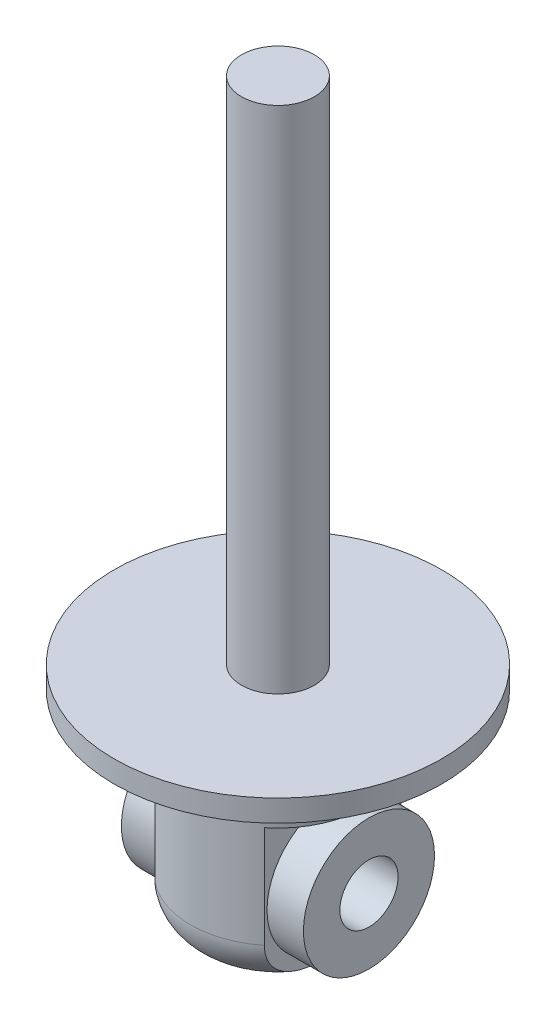
ISO-10303-21;
HEADER;
FILE_DESCRIPTION(('STEP AP214'),'2;1');
FILE_NAME('part.step','',(''),(''),'','','');
FILE_SCHEMA(('AUTOMOTIVE_DESIGN { 1 0 10303 214 1 1 1 1 }'));
ENDSEC;
DATA;
#1=APPLICATION_CONTEXT('core data for automotive mechanical design processes');
#2=APPLICATION_PROTOCOL_DEFINITION('international standard','automotive_design',2000,#1);
#3=PRODUCT_CONTEXT('',#1,'mechanical');
#4=PRODUCT('Part','Part','',(#3));
#5=PRODUCT_RELATED_PRODUCT_CATEGORY('part','',(#4));
#6=PRODUCT_DEFINITION_FORMATION('','',#4);
#7=PRODUCT_DEFINITION_CONTEXT('part definition',#1,'design');
#8=PRODUCT_DEFINITION('design','',#6,#7);
#9=PRODUCT_DEFINITION_SHAPE('','',#8);
#10=(LENGTH_UNIT() NAMED_UNIT(*) SI_UNIT(.MILLI.,.METRE.));
#11=(NAMED_UNIT(*) PLANE_ANGLE_UNIT() SI_UNIT($,.RADIAN.));
#12=(NAMED_UNIT(*) SI_UNIT($,.STERADIAN.) SOLID_ANGLE_UNIT());
#13=UNCERTAINTY_MEASURE_WITH_UNIT(LENGTH_MEASURE(1.E-05),#10,'distance_accuracy_value','');
#14=(GEOMETRIC_REPRESENTATION_CONTEXT(3) GLOBAL_UNCERTAINTY_ASSIGNED_CONTEXT((#13)) GLOBAL_UNIT_ASSIGNED_CONTEXT((#10,
#11,#12)) REPRESENTATION_CONTEXT('',''));
#15=CARTESIAN_POINT('',(0.,0.,0.));
#16=DIRECTION('',(0.,0.,1.));
#17=DIRECTION('',(1.,0.,0.));
#18=AXIS2_PLACEMENT_3D('',#15,#16,#17);
#19=CARTESIAN_POINT('',(-7.5,-28.,-14.));
#20=DIRECTION('',(1.,0.,0.));
#21=DIRECTION('',(0.,0.,-1.));
#22=AXIS2_PLACEMENT_3D('',#19,#20,#21);
#23=PLANE('',#22);
#24=CARTESIAN_POINT('',(-7.5,-27.8094750193111,0.));
#25=CARTESIAN_POINT('',(-7.5,-27.8094752958151,0.18452162824242));
#26=CARTESIAN_POINT('',(-7.5,-27.8077270322999,0.369043480287192));
#27=CARTESIAN_POINT('',(-7.5,-27.8006130628877,0.737999394292285));
#28=CARTESIAN_POINT('',(-7.5,-27.7952477367066,0.922433463434385));
#29=CARTESIAN_POINT('',(-7.5,-27.780538513706,1.29122559425462));
#30=CARTESIAN_POINT('',(-7.5,-27.7711929215574,1.47558358999919));
#31=CARTESIAN_POINT('',(-7.5,-27.7479507640883,1.84401846668315));
#32=CARTESIAN_POINT('',(-7.5,-27.734054140347,2.02809534398339));
#33=CARTESIAN_POINT('',(-7.5,-27.701027325669,2.39498843631837));
#34=CARTESIAN_POINT('',(-7.5,-27.6819201299087,2.57780665418326));
#35=CARTESIAN_POINT('',(-7.5,-27.6375682217561,2.94269408038084));
#36=CARTESIAN_POINT('',(-7.5,-27.6123230495969,3.12476323156505));
#37=CARTESIAN_POINT('',(-7.5,-27.5259360262262,3.6691632505479));
#38=CARTESIAN_POINT('',(-7.5,-27.4541196223952,4.02997739530099));
#39=CARTESIAN_POINT('',(-7.5,-27.315114172541,4.57935988961709));
#40=CARTESIAN_POINT('',(-7.5,-27.2608348848703,4.77122256452969));
#41=CARTESIAN_POINT('',(-7.5,-27.1402411036094,5.15109529504943));
#42=CARTESIAN_POINT('',(-7.5,-27.0739312594077,5.33910680786539));
#43=CARTESIAN_POINT('',(-7.5,-26.9281486989919,5.70992505463463));
#44=CARTESIAN_POINT('',(-7.5,-26.8486797977089,5.8927332791208));
#45=CARTESIAN_POINT('',(-7.5,-26.6756224712841,6.25155879665883));
#46=CARTESIAN_POINT('',(-7.5,-26.5820364486501,6.42757723883459));
#47=CARTESIAN_POINT('',(-7.5,-26.3958384208508,6.74413785402998));
#48=CARTESIAN_POINT('',(-7.5,-26.3053527427416,6.8859302136676));
#49=CARTESIAN_POINT('',(-7.5,-26.1136422044668,7.16205254122039));
#50=CARTESIAN_POINT('',(-7.5,-26.0124194056704,7.29638393401336));
#51=CARTESIAN_POINT('',(-7.5,-25.7991822855038,7.55627452274061));
#52=CARTESIAN_POINT('',(-7.5,-25.6871652583255,7.6818315054992));
#53=CARTESIAN_POINT('',(-7.5,-25.4525813942248,7.92270374400352));
#54=CARTESIAN_POINT('',(-7.5,-25.3300144777409,8.03801892249803));
#55=CARTESIAN_POINT('',(-7.5,-25.0736714823962,8.25792234562975));
#56=CARTESIAN_POINT('',(-7.5,-24.9398051473305,8.36240569865935));
#57=CARTESIAN_POINT('',(-7.5,-24.662616920615,8.55796576900282));
#58=CARTESIAN_POINT('',(-7.5,-24.5192963548439,8.64904436046083));
#59=CARTESIAN_POINT('',(-7.5,-24.2243409104845,8.81636481076627));
#60=CARTESIAN_POINT('',(-7.5,-24.0727112205184,8.89261579636783));
#61=CARTESIAN_POINT('',(-7.5,-23.7624095052739,9.02909243430965));
#62=CARTESIAN_POINT('',(-7.5,-23.6037388369551,9.08932115899453));
#63=CARTESIAN_POINT('',(-7.5,-23.3052245459151,9.1849514334904));
#64=CARTESIAN_POINT('',(-7.5,-23.1661361294911,9.22272405795733));
#65=CARTESIAN_POINT('',(-7.5,-22.8851087613884,9.28547940350163));
#66=CARTESIAN_POINT('',(-7.5,-22.7431701638949,9.31046370365637));
#67=CARTESIAN_POINT('',(-7.5,-22.4576599589478,9.34730641699015));
#68=CARTESIAN_POINT('',(-7.5,-22.3140890586128,9.35917031033292));
#69=CARTESIAN_POINT('',(-7.5,-22.0264648581988,9.36963164548865));
#70=CARTESIAN_POINT('',(-7.5,-21.8824115750842,9.36822954903947));
#71=CARTESIAN_POINT('',(-7.5,-21.6061914815275,9.35280339576898));
#72=CARTESIAN_POINT('',(-7.5,-21.4739684759153,9.33976569953801));
#73=CARTESIAN_POINT('',(-7.5,-21.2110534946456,9.3025636387872));
#74=CARTESIAN_POINT('',(-7.5,-21.0803620180608,9.27839574533066));
#75=CARTESIAN_POINT('',(-7.5,-20.8215410609612,9.21922065645586));
#76=CARTESIAN_POINT('',(-7.5,-20.6934101253726,9.1842198149556));
#77=CARTESIAN_POINT('',(-7.5,-20.4404340442512,9.1037455253616));
#78=CARTESIAN_POINT('',(-7.5,-20.3155901493276,9.05826815366643));
#79=CARTESIAN_POINT('',(-7.5,-20.0692031015505,8.95699564520569));
#80=CARTESIAN_POINT('',(-7.5,-19.9476868658852,8.90113499399755));
#81=CARTESIAN_POINT('',(-7.5,-19.7094920695403,8.77987692751896));
#82=CARTESIAN_POINT('',(-7.5,-19.5928152563103,8.71447610526943));
#83=CARTESIAN_POINT('',(-7.5,-19.2509911073174,8.50489875856371));
#84=CARTESIAN_POINT('',(-7.5,-19.0339195251877,8.34729299116934));
#85=CARTESIAN_POINT('',(-7.5,-18.609337427954,7.98870608163153));
#86=CARTESIAN_POINT('',(-7.5,-18.4039002281567,7.78529755950601));
#87=CARTESIAN_POINT('',(-7.5,-18.0246758733926,7.35109040646743));
#88=CARTESIAN_POINT('',(-7.5,-17.8508837047537,7.12029612399674));
#89=CARTESIAN_POINT('',(-7.5,-17.5744409595824,6.69864287979115));
#90=CARTESIAN_POINT('',(-7.5,-17.4648689537028,6.51223410047273));
#91=CARTESIAN_POINT('',(-7.5,-17.2626904112623,6.13034538679086));
#92=CARTESIAN_POINT('',(-7.5,-17.1700919878543,5.93486117014358));
#93=CARTESIAN_POINT('',(-7.5,-17.0006313082269,5.53658641063457));
#94=CARTESIAN_POINT('',(-7.5,-16.9238147555949,5.3337765932138));
#95=CARTESIAN_POINT('',(-7.5,-16.784875362625,4.9233142846081));
#96=CARTESIAN_POINT('',(-7.5,-16.7227484430634,4.71566315546474));
#97=CARTESIAN_POINT('',(-7.5,-16.5386673542946,4.02250667384635));
#98=CARTESIAN_POINT('',(-7.5,-16.4449803111871,3.52942656369882));
#99=CARTESIAN_POINT('',(-7.5,-16.3412352530644,2.78498720051467));
#100=CARTESIAN_POINT('',(-7.5,-16.3127705467372,2.5356855777005));
#101=CARTESIAN_POINT('',(-7.5,-16.2658269581612,2.03612434937439));
#102=CARTESIAN_POINT('',(-7.5,-16.2473468655649,1.78586486368142));
#103=CARTESIAN_POINT('',(-7.5,-16.2184283009414,1.28363112408653));
#104=CARTESIAN_POINT('',(-7.5,-16.208031590786,1.03165466176092));
#105=CARTESIAN_POINT('',(-7.5,-16.1941849220444,0.527501194688685));
#106=CARTESIAN_POINT('',(-7.5,-16.1907352988047,0.275324180848917));
#107=CARTESIAN_POINT('',(-7.5,-16.1903333462322,-0.228731345602969));
#108=CARTESIAN_POINT('',(-7.5,-16.193373232494,-0.480609853630167));
#109=CARTESIAN_POINT('',(-7.5,-16.2063332691715,-0.984173581494259));
#110=CARTESIAN_POINT('',(-7.5,-16.2162528039696,-1.23585881660873));
#111=CARTESIAN_POINT('',(-7.5,-16.2454935008677,-1.76278825668933));
#112=CARTESIAN_POINT('',(-7.5,-16.2656211327378,-2.03798990109171));
#113=CARTESIAN_POINT('',(-7.5,-16.3180418431017,-2.58731345976838));
#114=CARTESIAN_POINT('',(-7.5,-16.3503365349836,-2.86143522597443));
#115=CARTESIAN_POINT('',(-7.5,-16.4300545548583,-3.40623279358436));
#116=CARTESIAN_POINT('',(-7.5,-16.4774071358833,-3.67691867401873));
#117=CARTESIAN_POINT('',(-7.5,-16.5907053400646,-4.21439476079951));
#118=CARTESIAN_POINT('',(-7.5,-16.6566449229111,-4.4811862031647));
#119=CARTESIAN_POINT('',(-7.5,-16.7911834026755,-4.94217748017442));
#120=CARTESIAN_POINT('',(-7.5,-16.8549558474619,-5.13778160857807));
#121=CARTESIAN_POINT('',(-7.5,-16.9961265709521,-5.5239942274174));
#122=CARTESIAN_POINT('',(-7.5,-17.0735207892669,-5.71460418712136));
#123=CARTESIAN_POINT('',(-7.5,-17.2430793617625,-6.08921987221889));
#124=CARTESIAN_POINT('',(-7.5,-17.3352463319138,-6.27322442084438));
#125=CARTESIAN_POINT('',(-7.5,-17.5351759469553,-6.63256976145457));
#126=CARTESIAN_POINT('',(-7.5,-17.6429345063483,-6.80791280693597));
#127=CARTESIAN_POINT('',(-7.5,-17.8487615005736,-7.10989658300674));
#128=CARTESIAN_POINT('',(-7.5,-17.9436617626469,-7.23870103997639));
#129=CARTESIAN_POINT('',(-7.5,-18.143229826346,-7.48856622066219));
#130=CARTESIAN_POINT('',(-7.5,-18.2478987883735,-7.60962602152205));
#131=CARTESIAN_POINT('',(-7.5,-18.4668045949393,-7.84271387792474));
#132=CARTESIAN_POINT('',(-7.5,-18.5810384459287,-7.95474473789612));
#133=CARTESIAN_POINT('',(-7.5,-18.8187268203134,-8.16854933672494));
#134=CARTESIAN_POINT('',(-7.5,-18.9421800591116,-8.27032449994957));
#135=CARTESIAN_POINT('',(-7.5,-19.1987356397018,-8.46313596223061));
#136=CARTESIAN_POINT('',(-7.5,-19.3319055781875,-8.55408255407202));
#137=CARTESIAN_POINT('',(-7.5,-19.6061418402457,-8.72304401015934));
#138=CARTESIAN_POINT('',(-7.5,-19.747204378254,-8.80106500403696));
#139=CARTESIAN_POINT('',(-7.5,-20.0362068877473,-8.94309470867639));
#140=CARTESIAN_POINT('',(-7.5,-20.1841460034049,-9.00710515749598));
#141=CARTESIAN_POINT('',(-7.5,-20.4856380297523,-9.12014361193693));
#142=CARTESIAN_POINT('',(-7.5,-20.6391901444676,-9.16917373274798));
#143=CARTESIAN_POINT('',(-7.5,-20.9313639562727,-9.24643392787081));
#144=CARTESIAN_POINT('',(-7.5,-21.0695088202567,-9.27647685632879));
#145=CARTESIAN_POINT('',(-7.5,-21.3479315795213,-9.32406143536891));
#146=CARTESIAN_POINT('',(-7.5,-21.4882092809526,-9.34160421520928));
#147=CARTESIAN_POINT('',(-7.5,-21.769719609589,-9.36396002322678));
#148=CARTESIAN_POINT('',(-7.5,-21.9109518422674,-9.36877802253041));
#149=CARTESIAN_POINT('',(-7.5,-22.1932734390957,-9.36563613906261));
#150=CARTESIAN_POINT('',(-7.5,-22.3343628067459,-9.35767657732182));
#151=CARTESIAN_POINT('',(-7.5,-22.6064011749062,-9.32998563551062));
#152=CARTESIAN_POINT('',(-7.5,-22.7374295539783,-9.31102660205278));
#153=CARTESIAN_POINT('',(-7.5,-22.9974780227225,-9.26218788836622));
#154=CARTESIAN_POINT('',(-7.5,-23.1264974548056,-9.23230470755187));
#155=CARTESIAN_POINT('',(-7.5,-23.3815508516767,-9.16196479385525));
#156=CARTESIAN_POINT('',(-7.5,-23.5075862018083,-9.12151307666088));
#157=CARTESIAN_POINT('',(-7.5,-23.7559772755244,-9.03044888037393));
#158=CARTESIAN_POINT('',(-7.5,-23.8783315975104,-8.97983258590814));
#159=CARTESIAN_POINT('',(-7.5,-24.1205569584555,-8.8680617574251));
#160=CARTESIAN_POINT('',(-7.5,-24.2403549182387,-8.80674877020291));
#161=CARTESIAN_POINT('',(-7.5,-24.4747211723639,-8.67480187441993));
#162=CARTESIAN_POINT('',(-7.5,-24.5892875713423,-8.60416462323317));
#163=CARTESIAN_POINT('',(-7.5,-24.9242270275788,-8.37928997825773));
#164=CARTESIAN_POINT('',(-7.5,-25.13600210755,-8.21201407264852));
#165=CARTESIAN_POINT('',(-7.5,-25.5504485361803,-7.832942739178));
#166=CARTESIAN_POINT('',(-7.5,-25.7507010772538,-7.618532285847));
#167=CARTESIAN_POINT('',(-7.5,-26.1185076671662,-7.16337882817298));
#168=CARTESIAN_POINT('',(-7.5,-26.2860513710234,-6.9226275303298));
#169=CARTESIAN_POINT('',(-7.5,-26.5545024709803,-6.4788664395953));
#170=CARTESIAN_POINT('',(-7.5,-26.6619013252763,-6.279707295078));
#171=CARTESIAN_POINT('',(-7.5,-26.858559219587,-5.87254463104013));
#172=CARTESIAN_POINT('',(-7.5,-26.9478095430477,-5.66453691936401));
#173=CARTESIAN_POINT('',(-7.5,-27.1096214973705,-5.24180758530232));
#174=CARTESIAN_POINT('',(-7.5,-27.1821555960046,-5.02707553901331));
#175=CARTESIAN_POINT('',(-7.5,-27.3121001369762,-4.59305326757355));
#176=CARTESIAN_POINT('',(-7.5,-27.3695048137837,-4.37376133898656));
#177=CARTESIAN_POINT('',(-7.5,-27.4981886749365,-3.81417726059937));
#178=CARTESIAN_POINT('',(-7.5,-27.5604951716191,-3.47183296905169));
#179=CARTESIAN_POINT('',(-7.5,-27.6609019684328,-2.78359200614869));
#180=CARTESIAN_POINT('',(-7.5,-27.6989863972919,-2.43769315620305));
#181=CARTESIAN_POINT('',(-7.5,-27.7425563308733,-1.91723181279188));
#182=CARTESIAN_POINT('',(-7.5,-27.7548291128016,-1.74318957751326));
#183=CARTESIAN_POINT('',(-7.5,-27.7753986995787,-1.39487161182967));
#184=CARTESIAN_POINT('',(-7.5,-27.7836956019396,-1.22059588725638));
#185=CARTESIAN_POINT('',(-7.5,-27.796777523185,-0.871965392986039));
#186=CARTESIAN_POINT('',(-7.5,-27.8015635129394,-0.69761065849217));
#187=CARTESIAN_POINT('',(-7.5,-27.8079121855994,-0.348837350643893));
#188=CARTESIAN_POINT('',(-7.5,-27.8094747579462,-0.174418775305038));
#189=CARTESIAN_POINT('',(-7.5,-27.8094750193111,0.));
#190=B_SPLINE_CURVE_WITH_KNOTS('',3,(#24,#25,#26,#27,#28,#29,#30,#31,#32,#33,#34,#35,#36,#37,
#38,#39,#40,#41,#42,#43,#44,#45,#46,#47,#48,#49,#50,#51,#52,#53,#54,#55,#56,#57,#58,#59,#60,#61,
#62,#63,#64,#65,#66,#67,#68,#69,#70,#71,#72,#73,#74,#75,#76,#77,#78,#79,#80,#81,#82,#83,#84,#85,
#86,#87,#88,#89,#90,#91,#92,#93,#94,#95,#96,#97,#98,#99,#100,#101,#102,#103,#104,#105,#106,#107,
#108,#109,#110,#111,#112,#113,#114,#115,#116,#117,#118,#119,#120,#121,#122,#123,#124,#125,#126,
#127,#128,#129,#130,#131,#132,#133,#134,#135,#136,#137,#138,#139,#140,#141,#142,#143,#144,#145,
#146,#147,#148,#149,#150,#151,#152,#153,#154,#155,#156,#157,#158,#159,#160,#161,#162,#163,#164,
#165,#166,#167,#168,#169,#170,#171,#172,#173,#174,#175,#176,#177,#178,#179,#180,#181,#182,#183,
#184,#185,#186,#187,#188,#189),.UNSPECIFIED.,.T.,.F.,(4,2,2,2,2,2,2,2,2,2,2,2,2,2,2,2,2,2,2,2,2,
2,2,2,2,2,2,2,2,2,2,2,2,2,2,2,2,2,2,2,2,2,2,2,2,2,2,2,2,2,2,2,2,2,2,2,2,2,2,2,2,2,2,2,2,2,2,2,2,
2,2,2,2,2,2,2,2,2,2,2,2,2,4),(0.,0.553556541747909,1.10705498067111,1.66078940935171,
2.21453094651203,2.7658672034967,3.31724477121585,4.41912680182767,5.01698525599297,
5.61461314908642,6.21206808675634,6.80942146164093,7.31357153503217,7.81762499361292,
8.32180513447662,8.82598907791493,9.33467160980088,9.84328295415676,10.3515802378956,
10.8597799828438,11.291588037567,11.7233427606026,12.1549170790764,12.5864763761707,
12.9845986570771,13.3828472534997,13.7808627038906,14.1790274594522,14.579795450788,
14.9807069160888,15.7821103743006,16.6461503316802,17.5100532757815,18.1578732554314,
18.8060020817716,19.4559821948789,20.1057815998326,21.6069748462105,22.3596793389022,
23.1122925673176,23.8687687149109,24.6252813779039,25.3808870860739,26.1364251884592,
26.9640249034878,27.7917343993232,28.6156111127982,29.4392203950451,30.0559954213971,
30.6725869093732,31.2892877047367,31.9058271963482,32.3853559200308,32.8649416785199,
33.3443778968313,33.823747436381,34.3068464150843,34.7897156366603,35.2725249226045,
35.7552660053908,36.1788379642464,36.6023716529342,37.0257398573389,37.4490974249689,
37.8458122806135,38.2426543730445,38.6393084704929,39.0361117351622,39.4393886143668,
39.8428104576491,40.6491243408277,41.5260051520067,42.403162850804,43.0810551134699,
43.7592721958252,44.4385984678267,45.1181832448308,46.1608437011148,47.2041866484774,
47.7275747628343,48.2509500399341,48.7741805338585,49.2974289735857),.UNSPECIFIED.);
#191=CARTESIAN_POINT('',(-7.5,-22.,-9.3674969975976));
#192=VERTEX_POINT('',#191);
#193=CARTESIAN_POINT('',(-7.5,-21.9999999999999,9.36749699759766));
#194=VERTEX_POINT('',#193);
#195=EDGE_CURVE('E130',#192,#194,#190,.T.);
#196=ORIENTED_EDGE('',*,*,#195,.T.);
#197=DIRECTION('',(0.,1.,0.));
#198=VECTOR('',#197,1.);
#199=CARTESIAN_POINT('',(-7.5,-28.,9.3674969975976));
#200=LINE('',#199,#198);
#201=CARTESIAN_POINT('',(-7.5,-8.,9.3674969975976));
#202=VERTEX_POINT('',#201);
#203=EDGE_CURVE('E93',#202,#194,#200,.F.);
#204=ORIENTED_EDGE('',*,*,#203,.F.);
#205=DIRECTION('',(0.,0.,1.));
#206=VECTOR('',#205,1.);
#207=CARTESIAN_POINT('',(-7.5,-8.,-14.));
#208=LINE('',#207,#206);
#209=CARTESIAN_POINT('',(-7.5,-8.,-9.3674969975976));
#210=VERTEX_POINT('',#209);
#211=EDGE_CURVE('E86',#210,#202,#208,.T.);
#212=ORIENTED_EDGE('',*,*,#211,.F.);
#213=DIRECTION('',(0.,1.,0.));
#214=VECTOR('',#213,1.);
#215=CARTESIAN_POINT('',(-7.5,-28.,-9.3674969975976));
#216=LINE('',#215,#214);
#217=EDGE_CURVE('E64',#192,#210,#216,.T.);
#218=ORIENTED_EDGE('',*,*,#217,.F.);
#219=EDGE_LOOP('',(#196,#204,#212,#218));
#220=FACE_BOUND('',#219,.T.);
#221=CARTESIAN_POINT('',(-7.5,-18.,0.));
#222=DIRECTION('',(1.,0.,0.));
#223=DIRECTION('',(0.,0.,-1.));
#224=AXIS2_PLACEMENT_3D('',#221,#222,#223);
#225=CIRCLE('',#224,9.);
#226=CARTESIAN_POINT('',(-7.5,-18.,-9.));
#227=VERTEX_POINT('',#226);
#228=EDGE_CURVE('E11',#227,#227,#225,.F.);
#229=ORIENTED_EDGE('',*,*,#228,.F.);
#230=EDGE_LOOP('',(#229));
#231=FACE_BOUND('',#230,.T.);
#232=ADVANCED_FACE('F39',(#220,#231),#23,.F.);
#233=CARTESIAN_POINT('',(7.5,-28.,-14.));
#234=DIRECTION('',(-1.,0.,0.));
#235=DIRECTION('',(0.,0.,1.));
#236=AXIS2_PLACEMENT_3D('',#233,#234,#235);
#237=PLANE('',#236);
#238=CARTESIAN_POINT('',(7.5,-27.8094750193111,0.));
#239=CARTESIAN_POINT('',(7.5,-27.8094752958151,-0.18452162824242));
#240=CARTESIAN_POINT('',(7.5,-27.8077270322999,-0.369043480287192));
#241=CARTESIAN_POINT('',(7.5,-27.8006130628877,-0.737999394292285));
#242=CARTESIAN_POINT('',(7.5,-27.7952477367066,-0.922433463434385));
#243=CARTESIAN_POINT('',(7.5,-27.780538513706,-1.29122559425462));
#244=CARTESIAN_POINT('',(7.5,-27.7711929215574,-1.47558358999919));
#245=CARTESIAN_POINT('',(7.5,-27.7479507640883,-1.84401846668315));
#246=CARTESIAN_POINT('',(7.5,-27.734054140347,-2.02809534398339));
#247=CARTESIAN_POINT('',(7.5,-27.701027325669,-2.39498843631837));
#248=CARTESIAN_POINT('',(7.5,-27.6819201299087,-2.57780665418326));
#249=CARTESIAN_POINT('',(7.5,-27.6375682217561,-2.94269408038084));
#250=CARTESIAN_POINT('',(7.5,-27.6123230495969,-3.12476323156505));
#251=CARTESIAN_POINT('',(7.5,-27.5259360262262,-3.6691632505479));
#252=CARTESIAN_POINT('',(7.5,-27.4541196223952,-4.02997739530099));
#253=CARTESIAN_POINT('',(7.5,-27.315114172541,-4.57935988961709));
#254=CARTESIAN_POINT('',(7.5,-27.2608348848703,-4.77122256452969));
#255=CARTESIAN_POINT('',(7.5,-27.1402411036094,-5.15109529504943));
#256=CARTESIAN_POINT('',(7.5,-27.0739312594077,-5.33910680786539));
#257=CARTESIAN_POINT('',(7.5,-26.9281486989919,-5.70992505463463));
#258=CARTESIAN_POINT('',(7.5,-26.8486797977089,-5.8927332791208));
#259=CARTESIAN_POINT('',(7.5,-26.6756224712841,-6.25155879665883));
#260=CARTESIAN_POINT('',(7.5,-26.5820364486501,-6.42757723883459));
#261=CARTESIAN_POINT('',(7.5,-26.3958384208508,-6.74413785402998));
#262=CARTESIAN_POINT('',(7.5,-26.3053527427416,-6.8859302136676));
#263=CARTESIAN_POINT('',(7.5,-26.1136422044668,-7.16205254122039));
#264=CARTESIAN_POINT('',(7.5,-26.0124194056704,-7.29638393401336));
#265=CARTESIAN_POINT('',(7.5,-25.7991822855038,-7.55627452274061));
#266=CARTESIAN_POINT('',(7.5,-25.6871652583255,-7.6818315054992));
#267=CARTESIAN_POINT('',(7.5,-25.4525813942248,-7.92270374400352));
#268=CARTESIAN_POINT('',(7.5,-25.3300144777409,-8.03801892249803));
#269=CARTESIAN_POINT('',(7.5,-25.0736714823962,-8.25792234562975));
#270=CARTESIAN_POINT('',(7.5,-24.9398051473305,-8.36240569865935));
#271=CARTESIAN_POINT('',(7.5,-24.662616920615,-8.55796576900282));
#272=CARTESIAN_POINT('',(7.5,-24.5192963548439,-8.64904436046083));
#273=CARTESIAN_POINT('',(7.5,-24.2243409104845,-8.81636481076627));
#274=CARTESIAN_POINT('',(7.5,-24.0727112205184,-8.89261579636783));
#275=CARTESIAN_POINT('',(7.5,-23.7624095052739,-9.02909243430965));
#276=CARTESIAN_POINT('',(7.5,-23.6037388369551,-9.08932115899453));
#277=CARTESIAN_POINT('',(7.5,-23.3052245459151,-9.1849514334904));
#278=CARTESIAN_POINT('',(7.5,-23.1661361294911,-9.22272405795733));
#279=CARTESIAN_POINT('',(7.5,-22.8851087613884,-9.28547940350163));
#280=CARTESIAN_POINT('',(7.5,-22.7431701638949,-9.31046370365637));
#281=CARTESIAN_POINT('',(7.5,-22.4576599589478,-9.34730641699015));
#282=CARTESIAN_POINT('',(7.5,-22.3140890586128,-9.35917031033292));
#283=CARTESIAN_POINT('',(7.5,-22.0264648581988,-9.36963164548865));
#284=CARTESIAN_POINT('',(7.5,-21.8824115750842,-9.36822954903947));
#285=CARTESIAN_POINT('',(7.5,-21.6061914815275,-9.35280339576898));
#286=CARTESIAN_POINT('',(7.5,-21.4739684759153,-9.33976569953801));
#287=CARTESIAN_POINT('',(7.5,-21.2110534946456,-9.3025636387872));
#288=CARTESIAN_POINT('',(7.5,-21.0803620180608,-9.27839574533066));
#289=CARTESIAN_POINT('',(7.5,-20.8215410609612,-9.21922065645586));
#290=CARTESIAN_POINT('',(7.5,-20.6934101253726,-9.1842198149556));
#291=CARTESIAN_POINT('',(7.5,-20.4404340442512,-9.1037455253616));
#292=CARTESIAN_POINT('',(7.5,-20.3155901493276,-9.05826815366643));
#293=CARTESIAN_POINT('',(7.5,-20.0692031015505,-8.95699564520569));
#294=CARTESIAN_POINT('',(7.5,-19.9476868658852,-8.90113499399755));
#295=CARTESIAN_POINT('',(7.5,-19.7094920695403,-8.77987692751896));
#296=CARTESIAN_POINT('',(7.5,-19.5928152563103,-8.71447610526943));
#297=CARTESIAN_POINT('',(7.5,-19.2509911073174,-8.50489875856371));
#298=CARTESIAN_POINT('',(7.5,-19.0339195251877,-8.34729299116934));
#299=CARTESIAN_POINT('',(7.5,-18.609337427954,-7.98870608163153));
#300=CARTESIAN_POINT('',(7.5,-18.4039002281567,-7.78529755950601));
#301=CARTESIAN_POINT('',(7.5,-18.0246758733926,-7.35109040646743));
#302=CARTESIAN_POINT('',(7.5,-17.8508837047537,-7.12029612399674));
#303=CARTESIAN_POINT('',(7.5,-17.5744409595824,-6.69864287979115));
#304=CARTESIAN_POINT('',(7.5,-17.4648689537028,-6.51223410047273));
#305=CARTESIAN_POINT('',(7.5,-17.2626904112623,-6.13034538679086));
#306=CARTESIAN_POINT('',(7.5,-17.1700919878543,-5.93486117014358));
#307=CARTESIAN_POINT('',(7.5,-17.0006313082269,-5.53658641063457));
#308=CARTESIAN_POINT('',(7.5,-16.9238147555949,-5.3337765932138));
#309=CARTESIAN_POINT('',(7.5,-16.784875362625,-4.9233142846081));
#310=CARTESIAN_POINT('',(7.5,-16.7227484430634,-4.71566315546474));
#311=CARTESIAN_POINT('',(7.5,-16.5386673542946,-4.02250667384635));
#312=CARTESIAN_POINT('',(7.5,-16.4449803111871,-3.52942656369882));
#313=CARTESIAN_POINT('',(7.5,-16.3412352530644,-2.78498720051467));
#314=CARTESIAN_POINT('',(7.5,-16.3127705467372,-2.5356855777005));
#315=CARTESIAN_POINT('',(7.5,-16.2658269581612,-2.03612434937439));
#316=CARTESIAN_POINT('',(7.5,-16.2473468655649,-1.78586486368142));
#317=CARTESIAN_POINT('',(7.5,-16.2184283009414,-1.28363112408653));
#318=CARTESIAN_POINT('',(7.5,-16.208031590786,-1.03165466176092));
#319=CARTESIAN_POINT('',(7.5,-16.1941849220444,-0.527501194688685));
#320=CARTESIAN_POINT('',(7.5,-16.1907352988047,-0.275324180848917));
#321=CARTESIAN_POINT('',(7.5,-16.1903333462322,0.228731345602969));
#322=CARTESIAN_POINT('',(7.5,-16.193373232494,0.480609853630167));
#323=CARTESIAN_POINT('',(7.5,-16.2063332691715,0.984173581494259));
#324=CARTESIAN_POINT('',(7.5,-16.2162528039696,1.23585881660873));
#325=CARTESIAN_POINT('',(7.5,-16.2454935008677,1.76278825668933));
#326=CARTESIAN_POINT('',(7.5,-16.2656211327378,2.03798990109171));
#327=CARTESIAN_POINT('',(7.5,-16.3180418431017,2.58731345976838));
#328=CARTESIAN_POINT('',(7.5,-16.3503365349836,2.86143522597443));
#329=CARTESIAN_POINT('',(7.5,-16.4300545548583,3.40623279358436));
#330=CARTESIAN_POINT('',(7.5,-16.4774071358833,3.67691867401873));
#331=CARTESIAN_POINT('',(7.5,-16.5907053400646,4.21439476079951));
#332=CARTESIAN_POINT('',(7.5,-16.6566449229111,4.4811862031647));
#333=CARTESIAN_POINT('',(7.5,-16.7911834026755,4.94217748017442));
#334=CARTESIAN_POINT('',(7.5,-16.8549558474619,5.13778160857807));
#335=CARTESIAN_POINT('',(7.5,-16.9961265709521,5.5239942274174));
#336=CARTESIAN_POINT('',(7.5,-17.0735207892669,5.71460418712136));
#337=CARTESIAN_POINT('',(7.5,-17.2430793617625,6.08921987221889));
#338=CARTESIAN_POINT('',(7.5,-17.3352463319138,6.27322442084438));
#339=CARTESIAN_POINT('',(7.5,-17.5351759469553,6.63256976145457));
#340=CARTESIAN_POINT('',(7.5,-17.6429345063483,6.80791280693597));
#341=CARTESIAN_POINT('',(7.5,-17.8487615005736,7.10989658300674));
#342=CARTESIAN_POINT('',(7.5,-17.9436617626469,7.23870103997639));
#343=CARTESIAN_POINT('',(7.5,-18.143229826346,7.48856622066219));
#344=CARTESIAN_POINT('',(7.5,-18.2478987883735,7.60962602152205));
#345=CARTESIAN_POINT('',(7.5,-18.4668045949393,7.84271387792474));
#346=CARTESIAN_POINT('',(7.5,-18.5810384459287,7.95474473789612));
#347=CARTESIAN_POINT('',(7.5,-18.8187268203134,8.16854933672494));
#348=CARTESIAN_POINT('',(7.5,-18.9421800591116,8.27032449994957));
#349=CARTESIAN_POINT('',(7.5,-19.1987356397018,8.46313596223061));
#350=CARTESIAN_POINT('',(7.5,-19.3319055781875,8.55408255407202));
#351=CARTESIAN_POINT('',(7.5,-19.6061418402457,8.72304401015934));
#352=CARTESIAN_POINT('',(7.5,-19.747204378254,8.80106500403696));
#353=CARTESIAN_POINT('',(7.5,-20.0362068877473,8.94309470867639));
#354=CARTESIAN_POINT('',(7.5,-20.1841460034049,9.00710515749598));
#355=CARTESIAN_POINT('',(7.5,-20.4856380297523,9.12014361193693));
#356=CARTESIAN_POINT('',(7.5,-20.6391901444676,9.16917373274798));
#357=CARTESIAN_POINT('',(7.5,-20.9313639562727,9.24643392787081));
#358=CARTESIAN_POINT('',(7.5,-21.0695088202567,9.27647685632879));
#359=CARTESIAN_POINT('',(7.5,-21.3479315795213,9.32406143536891));
#360=CARTESIAN_POINT('',(7.5,-21.4882092809526,9.34160421520928));
#361=CARTESIAN_POINT('',(7.5,-21.769719609589,9.36396002322678));
#362=CARTESIAN_POINT('',(7.5,-21.9109518422674,9.36877802253041));
#363=CARTESIAN_POINT('',(7.5,-22.1932734390957,9.36563613906261));
#364=CARTESIAN_POINT('',(7.5,-22.3343628067459,9.35767657732182));
#365=CARTESIAN_POINT('',(7.5,-22.6064011749062,9.32998563551062));
#366=CARTESIAN_POINT('',(7.5,-22.7374295539783,9.31102660205278));
#367=CARTESIAN_POINT('',(7.5,-22.9974780227225,9.26218788836622));
#368=CARTESIAN_POINT('',(7.5,-23.1264974548056,9.23230470755187));
#369=CARTESIAN_POINT('',(7.5,-23.3815508516767,9.16196479385525));
#370=CARTESIAN_POINT('',(7.5,-23.5075862018083,9.12151307666088));
#371=CARTESIAN_POINT('',(7.5,-23.7559772755244,9.03044888037393));
#372=CARTESIAN_POINT('',(7.5,-23.8783315975104,8.97983258590814));
#373=CARTESIAN_POINT('',(7.5,-24.1205569584555,8.8680617574251));
#374=CARTESIAN_POINT('',(7.5,-24.2403549182387,8.80674877020291));
#375=CARTESIAN_POINT('',(7.5,-24.4747211723639,8.67480187441993));
#376=CARTESIAN_POINT('',(7.5,-24.5892875713423,8.60416462323317));
#377=CARTESIAN_POINT('',(7.5,-24.9242270275788,8.37928997825773));
#378=CARTESIAN_POINT('',(7.5,-25.13600210755,8.21201407264852));
#379=CARTESIAN_POINT('',(7.5,-25.5504485361803,7.832942739178));
#380=CARTESIAN_POINT('',(7.5,-25.7507010772538,7.618532285847));
#381=CARTESIAN_POINT('',(7.5,-26.1185076671662,7.16337882817298));
#382=CARTESIAN_POINT('',(7.5,-26.2860513710234,6.9226275303298));
#383=CARTESIAN_POINT('',(7.5,-26.5545024709803,6.4788664395953));
#384=CARTESIAN_POINT('',(7.5,-26.6619013252763,6.279707295078));
#385=CARTESIAN_POINT('',(7.5,-26.858559219587,5.87254463104013));
#386=CARTESIAN_POINT('',(7.5,-26.9478095430477,5.66453691936401));
#387=CARTESIAN_POINT('',(7.5,-27.1096214973705,5.24180758530232));
#388=CARTESIAN_POINT('',(7.5,-27.1821555960046,5.02707553901331));
#389=CARTESIAN_POINT('',(7.5,-27.3121001369762,4.59305326757355));
#390=CARTESIAN_POINT('',(7.5,-27.3695048137837,4.37376133898656));
#391=CARTESIAN_POINT('',(7.5,-27.4981886749365,3.81417726059937));
#392=CARTESIAN_POINT('',(7.5,-27.5604951716191,3.47183296905169));
#393=CARTESIAN_POINT('',(7.5,-27.6609019684328,2.78359200614869));
#394=CARTESIAN_POINT('',(7.5,-27.6989863972919,2.43769315620305));
#395=CARTESIAN_POINT('',(7.5,-27.7425563308733,1.91723181279188));
#396=CARTESIAN_POINT('',(7.5,-27.7548291128016,1.74318957751326));
#397=CARTESIAN_POINT('',(7.5,-27.7753986995787,1.39487161182967));
#398=CARTESIAN_POINT('',(7.5,-27.7836956019396,1.22059588725638));
#399=CARTESIAN_POINT('',(7.5,-27.796777523185,0.871965392986039));
#400=CARTESIAN_POINT('',(7.5,-27.8015635129394,0.69761065849217));
#401=CARTESIAN_POINT('',(7.5,-27.8079121855994,0.348837350643893));
#402=CARTESIAN_POINT('',(7.5,-27.8094747579462,0.174418775305038));
#403=CARTESIAN_POINT('',(7.5,-27.8094750193111,0.));
#404=B_SPLINE_CURVE_WITH_KNOTS('',3,(#238,#239,#240,#241,#242,#243,#244,#245,#246,#247,#248,
#249,#250,#251,#252,#253,#254,#255,#256,#257,#258,#259,#260,#261,#262,#263,#264,#265,#266,#267,
#268,#269,#270,#271,#272,#273,#274,#275,#276,#277,#278,#279,#280,#281,#282,#283,#284,#285,#286,
#287,#288,#289,#290,#291,#292,#293,#294,#295,#296,#297,#298,#299,#300,#301,#302,#303,#304,#305,
#306,#307,#308,#309,#310,#311,#312,#313,#314,#315,#316,#317,#318,#319,#320,#321,#322,#323,#324,
#325,#326,#327,#328,#329,#330,#331,#332,#333,#334,#335,#336,#337,#338,#339,#340,#341,#342,#343,
#344,#345,#346,#347,#348,#349,#350,#351,#352,#353,#354,#355,#356,#357,#358,#359,#360,#361,#362,
#363,#364,#365,#366,#367,#368,#369,#370,#371,#372,#373,#374,#375,#376,#377,#378,#379,#380,#381,
#382,#383,#384,#385,#386,#387,#388,#389,#390,#391,#392,#393,#394,#395,#396,#397,#398,#399,#400,
#401,#402,#403),.UNSPECIFIED.,.T.,.F.,(4,2,2,2,2,2,2,2,2,2,2,2,2,2,2,2,2,2,2,2,2,2,2,2,2,2,2,2,
2,2,2,2,2,2,2,2,2,2,2,2,2,2,2,2,2,2,2,2,2,2,2,2,2,2,2,2,2,2,2,2,2,2,2,2,2,2,2,2,2,2,2,2,2,2,2,2,
2,2,2,2,2,2,4),(0.,0.553556541747909,1.10705498067111,1.66078940935171,2.21453094651203,
2.7658672034967,3.31724477121585,4.41912680182767,5.01698525599297,5.61461314908642,
6.21206808675634,6.80942146164093,7.31357153503217,7.81762499361292,8.32180513447662,
8.82598907791493,9.33467160980088,9.84328295415676,10.3515802378956,10.8597799828438,
11.291588037567,11.7233427606026,12.1549170790764,12.5864763761707,12.9845986570771,
13.3828472534997,13.7808627038906,14.1790274594522,14.579795450788,14.9807069160888,
15.7821103743006,16.6461503316802,17.5100532757815,18.1578732554314,18.8060020817716,
19.4559821948789,20.1057815998326,21.6069748462105,22.3596793389022,23.1122925673176,
23.8687687149109,24.6252813779039,25.3808870860739,26.1364251884592,26.9640249034878,
27.7917343993232,28.6156111127982,29.4392203950451,30.0559954213971,30.6725869093732,
31.2892877047367,31.9058271963482,32.3853559200308,32.8649416785199,33.3443778968313,
33.823747436381,34.3068464150843,34.7897156366603,35.2725249226045,35.7552660053908,
36.1788379642464,36.6023716529342,37.0257398573389,37.4490974249689,37.8458122806135,
38.2426543730445,38.6393084704929,39.0361117351622,39.4393886143668,39.8428104576491,
40.6491243408277,41.5260051520067,42.403162850804,43.0810551134699,43.7592721958252,
44.4385984678267,45.1181832448308,46.1608437011148,47.2041866484774,47.7275747628343,
48.2509500399341,48.7741805338585,49.2974289735857),.UNSPECIFIED.);
#405=CARTESIAN_POINT('',(7.5,-22.,9.3674969975976));
#406=VERTEX_POINT('',#405);
#407=CARTESIAN_POINT('',(7.5,-21.9999999999999,-9.36749699759766));
#408=VERTEX_POINT('',#407);
#409=EDGE_CURVE('E90',#406,#408,#404,.T.);
#410=ORIENTED_EDGE('',*,*,#409,.T.);
#411=DIRECTION('',(0.,1.,0.));
#412=VECTOR('',#411,1.);
#413=CARTESIAN_POINT('',(7.5,-28.,-9.3674969975976));
#414=LINE('',#413,#412);
#415=CARTESIAN_POINT('',(7.5,-8.,-9.3674969975976));
#416=VERTEX_POINT('',#415);
#417=EDGE_CURVE('E104',#416,#408,#414,.F.);
#418=ORIENTED_EDGE('',*,*,#417,.F.);
#419=DIRECTION('',(0.,0.,1.));
#420=VECTOR('',#419,1.);
#421=CARTESIAN_POINT('',(7.5,-8.,-14.));
#422=LINE('',#421,#420);
#423=CARTESIAN_POINT('',(7.5,-8.,9.3674969975976));
#424=VERTEX_POINT('',#423);
#425=EDGE_CURVE('E94',#416,#424,#422,.T.);
#426=ORIENTED_EDGE('',*,*,#425,.T.);
#427=DIRECTION('',(0.,1.,0.));
#428=VECTOR('',#427,1.);
#429=CARTESIAN_POINT('',(7.5,-28.,9.3674969975976));
#430=LINE('',#429,#428);
#431=EDGE_CURVE('E56',#406,#424,#430,.T.);
#432=ORIENTED_EDGE('',*,*,#431,.F.);
#433=EDGE_LOOP('',(#410,#418,#426,#432));
#434=FACE_BOUND('',#433,.T.);
#435=CARTESIAN_POINT('',(7.5,-18.,0.));
#436=DIRECTION('',(-1.,0.,0.));
#437=DIRECTION('',(0.,0.,1.));
#438=AXIS2_PLACEMENT_3D('',#435,#436,#437);
#439=CIRCLE('',#438,9.);
#440=CARTESIAN_POINT('',(7.5,-18.,9.));
#441=VERTEX_POINT('',#440);
#442=EDGE_CURVE('E44',#441,#441,#439,.F.);
#443=ORIENTED_EDGE('',*,*,#442,.F.);
#444=EDGE_LOOP('',(#443));
#445=FACE_BOUND('',#444,.T.);
#446=ADVANCED_FACE('F143',(#434,#445),#237,.F.);
#447=CARTESIAN_POINT('',(0.,3.,0.));
#448=DIRECTION('',(0.,-1.,0.));
#449=DIRECTION('',(0.,0.,-1.));
#450=AXIS2_PLACEMENT_3D('',#447,#448,#449);
#451=CYLINDRICAL_SURFACE('',#450,22.5);
#452=CARTESIAN_POINT('',(0.,3.,0.));
#453=DIRECTION('',(0.,1.,0.));
#454=DIRECTION('',(0.,0.,1.));
#455=AXIS2_PLACEMENT_3D('',#452,#453,#454);
#456=CIRCLE('',#455,22.5);
#457=CARTESIAN_POINT('',(0.,3.,22.5));
#458=VERTEX_POINT('',#457);
#459=EDGE_CURVE('E121',#458,#458,#456,.T.);
#460=ORIENTED_EDGE('',*,*,#459,.F.);
#461=EDGE_LOOP('',(#460));
#462=FACE_BOUND('',#461,.T.);
#463=CARTESIAN_POINT('',(0.,0.,0.));
#464=DIRECTION('',(0.,1.,0.));
#465=DIRECTION('',(0.,0.,1.));
#466=AXIS2_PLACEMENT_3D('',#463,#464,#465);
#467=CIRCLE('',#466,22.5);
#468=CARTESIAN_POINT('',(0.,0.,22.5));
#469=VERTEX_POINT('',#468);
#470=EDGE_CURVE('E118',#469,#469,#467,.T.);
#471=ORIENTED_EDGE('',*,*,#470,.T.);
#472=EDGE_LOOP('',(#471));
#473=FACE_BOUND('',#472,.T.);
#474=ADVANCED_FACE('F167',(#462,#473),#451,.T.);
#475=CARTESIAN_POINT('',(0.,3.,0.));
#476=DIRECTION('',(0.,1.,0.));
#477=DIRECTION('',(0.,0.,1.));
#478=AXIS2_PLACEMENT_3D('',#475,#476,#477);
#479=PLANE('',#478);
#480=CARTESIAN_POINT('',(0.,3.,0.));
#481=DIRECTION('',(0.,1.,0.));
#482=DIRECTION('',(0.,0.,1.));
#483=AXIS2_PLACEMENT_3D('',#480,#481,#482);
#484=CIRCLE('',#483,5.);
#485=CARTESIAN_POINT('',(0.,3.,5.));
#486=VERTEX_POINT('',#485);
#487=EDGE_CURVE('E115',#486,#486,#484,.T.);
#488=ORIENTED_EDGE('',*,*,#487,.F.);
#489=EDGE_LOOP('',(#488));
#490=FACE_BOUND('',#489,.T.);
#491=ORIENTED_EDGE('',*,*,#459,.T.);
#492=EDGE_LOOP('',(#491));
#493=FACE_BOUND('',#492,.T.);
#494=ADVANCED_FACE('F164',(#490,#493),#479,.T.);
#495=CARTESIAN_POINT('',(0.,0.,0.));
#496=DIRECTION('',(0.,1.,0.));
#497=DIRECTION('',(0.,0.,1.));
#498=AXIS2_PLACEMENT_3D('',#495,#496,#497);
#499=PLANE('',#498);
#500=CARTESIAN_POINT('',(0.,0.,0.));
#501=DIRECTION('',(0.,-1.,0.));
#502=DIRECTION('',(0.,0.,-1.));
#503=AXIS2_PLACEMENT_3D('',#500,#501,#502);
#504=CIRCLE('',#503,12.);
#505=CARTESIAN_POINT('',(0.,0.,-12.));
#506=VERTEX_POINT('',#505);
#507=EDGE_CURVE('E111',#506,#506,#504,.T.);
#508=ORIENTED_EDGE('',*,*,#507,.F.);
#509=EDGE_LOOP('',(#508));
#510=FACE_BOUND('',#509,.T.);
#511=ORIENTED_EDGE('',*,*,#470,.F.);
#512=EDGE_LOOP('',(#511));
#513=FACE_BOUND('',#512,.T.);
#514=ADVANCED_FACE('F162',(#510,#513),#499,.F.);
#515=CARTESIAN_POINT('',(0.,73.,0.));
#516=DIRECTION('',(0.,-1.,0.));
#517=DIRECTION('',(0.,0.,-1.));
#518=AXIS2_PLACEMENT_3D('',#515,#516,#517);
#519=CYLINDRICAL_SURFACE('',#518,5.);
#520=CARTESIAN_POINT('',(0.,73.,0.));
#521=DIRECTION('',(0.,1.,0.));
#522=DIRECTION('',(0.,0.,1.));
#523=AXIS2_PLACEMENT_3D('',#520,#521,#522);
#524=CIRCLE('',#523,5.);
#525=CARTESIAN_POINT('',(0.,73.,5.));
#526=VERTEX_POINT('',#525);
#527=EDGE_CURVE('E110',#526,#526,#524,.T.);
#528=ORIENTED_EDGE('',*,*,#527,.F.);
#529=EDGE_LOOP('',(#528));
#530=FACE_BOUND('',#529,.T.);
#531=ORIENTED_EDGE('',*,*,#487,.T.);
#532=EDGE_LOOP('',(#531));
#533=FACE_BOUND('',#532,.T.);
#534=ADVANCED_FACE('F158',(#530,#533),#519,.T.);
#535=CARTESIAN_POINT('',(0.,73.,0.));
#536=DIRECTION('',(0.,1.,0.));
#537=DIRECTION('',(0.,0.,1.));
#538=AXIS2_PLACEMENT_3D('',#535,#536,#537);
#539=PLANE('',#538);
#540=ORIENTED_EDGE('',*,*,#527,.T.);
#541=EDGE_LOOP('',(#540));
#542=FACE_BOUND('',#541,.T.);
#543=ADVANCED_FACE('F155',(#542),#539,.T.);
#544=CARTESIAN_POINT('',(0.,-28.,0.));
#545=DIRECTION('',(0.,1.,0.));
#546=DIRECTION('',(0.,0.,1.));
#547=AXIS2_PLACEMENT_3D('',#544,#545,#546);
#548=CYLINDRICAL_SURFACE('',#547,12.);
#549=CARTESIAN_POINT('',(0.,-22.,0.));
#550=DIRECTION('',(0.,-1.,0.));
#551=DIRECTION('',(0.,0.,-1.));
#552=AXIS2_PLACEMENT_3D('',#549,#550,#551);
#553=CIRCLE('',#552,12.);
#554=EDGE_CURVE('E129',#194,#406,#553,.F.);
#555=ORIENTED_EDGE('',*,*,#554,.T.);
#556=ORIENTED_EDGE('',*,*,#431,.T.);
#557=CARTESIAN_POINT('',(0.,-8.,0.));
#558=DIRECTION('',(0.,1.,0.));
#559=DIRECTION('',(0.,0.,1.));
#560=AXIS2_PLACEMENT_3D('',#557,#558,#559);
#561=CIRCLE('',#560,12.);
#562=EDGE_CURVE('E89',#424,#416,#561,.T.);
#563=ORIENTED_EDGE('',*,*,#562,.T.);
#564=ORIENTED_EDGE('',*,*,#417,.T.);
#565=EDGE_CURVE('E103',#408,#192,#553,.F.);
#566=ORIENTED_EDGE('',*,*,#565,.T.);
#567=ORIENTED_EDGE('',*,*,#217,.T.);
#568=CARTESIAN_POINT('',(0.,-8.,0.));
#569=DIRECTION('',(0.,1.,0.));
#570=DIRECTION('',(0.,0.,1.));
#571=AXIS2_PLACEMENT_3D('',#568,#569,#570);
#572=CIRCLE('',#571,12.);
#573=EDGE_CURVE('E84',#210,#202,#572,.T.);
#574=ORIENTED_EDGE('',*,*,#573,.T.);
#575=ORIENTED_EDGE('',*,*,#203,.T.);
#576=EDGE_LOOP('',(#555,#556,#563,#564,#566,#567,#574,#575));
#577=FACE_BOUND('',#576,.T.);
#578=ORIENTED_EDGE('',*,*,#507,.T.);
#579=EDGE_LOOP('',(#578));
#580=FACE_BOUND('',#579,.T.);
#581=ADVANCED_FACE('F99',(#577,#580),#548,.T.);
#582=CARTESIAN_POINT('',(0.,-28.,0.));
#583=DIRECTION('',(0.,-1.,0.));
#584=DIRECTION('',(0.,0.,-1.));
#585=AXIS2_PLACEMENT_3D('',#582,#583,#584);
#586=PLANE('',#585);
#587=CARTESIAN_POINT('',(0.,-28.,0.));
#588=DIRECTION('',(0.,-1.,0.));
#589=DIRECTION('',(0.,0.,-1.));
#590=AXIS2_PLACEMENT_3D('',#587,#588,#589);
#591=CIRCLE('',#590,6.);
#592=CARTESIAN_POINT('',(0.,-28.,-6.));
#593=VERTEX_POINT('',#592);
#594=EDGE_CURVE('E114',#593,#593,#591,.T.);
#595=ORIENTED_EDGE('',*,*,#594,.T.);
#596=EDGE_LOOP('',(#595));
#597=FACE_BOUND('',#596,.T.);
#598=ADVANCED_FACE('F149',(#597),#586,.T.);
#599=CARTESIAN_POINT('',(0.,-22.,0.));
#600=DIRECTION('',(0.,-1.,0.));
#601=DIRECTION('',(0.,0.,-1.));
#602=AXIS2_PLACEMENT_3D('',#599,#600,#601);
#603=TOROIDAL_SURFACE('',#602,6.,6.);
#604=ORIENTED_EDGE('',*,*,#409,.F.);
#605=ORIENTED_EDGE('',*,*,#554,.F.);
#606=ORIENTED_EDGE('',*,*,#195,.F.);
#607=ORIENTED_EDGE('',*,*,#565,.F.);
#608=EDGE_LOOP('',(#604,#605,#606,#607));
#609=FACE_BOUND('',#608,.T.);
#610=ORIENTED_EDGE('',*,*,#594,.F.);
#611=EDGE_LOOP('',(#610));
#612=FACE_BOUND('',#611,.T.);
#613=ADVANCED_FACE('F41',(#609,#612),#603,.T.);
#614=CARTESIAN_POINT('',(-7.5,-8.,-14.));
#615=DIRECTION('',(0.,1.,0.));
#616=DIRECTION('',(0.,0.,1.));
#617=AXIS2_PLACEMENT_3D('',#614,#615,#616);
#618=PLANE('',#617);
#619=ORIENTED_EDGE('',*,*,#211,.T.);
#620=ORIENTED_EDGE('',*,*,#573,.F.);
#621=EDGE_LOOP('',(#619,#620));
#622=FACE_BOUND('',#621,.T.);
#623=ADVANCED_FACE('F85',(#622),#618,.F.);
#624=CARTESIAN_POINT('',(7.5,-8.,-14.));
#625=DIRECTION('',(0.,1.,0.));
#626=DIRECTION('',(0.,0.,1.));
#627=AXIS2_PLACEMENT_3D('',#624,#625,#626);
#628=PLANE('',#627);
#629=ORIENTED_EDGE('',*,*,#425,.F.);
#630=ORIENTED_EDGE('',*,*,#562,.F.);
#631=EDGE_LOOP('',(#629,#630));
#632=FACE_BOUND('',#631,.T.);
#633=ADVANCED_FACE('F148',(#632),#628,.F.);
#634=CARTESIAN_POINT('',(12.5,-18.,0.));
#635=DIRECTION('',(-1.,0.,0.));
#636=DIRECTION('',(0.,0.,1.));
#637=AXIS2_PLACEMENT_3D('',#634,#635,#636);
#638=CYLINDRICAL_SURFACE('',#637,9.);
#639=CARTESIAN_POINT('',(12.5,-18.,0.));
#640=DIRECTION('',(1.,0.,0.));
#641=DIRECTION('',(0.,0.,-1.));
#642=AXIS2_PLACEMENT_3D('',#639,#640,#641);
#643=CIRCLE('',#642,9.);
#644=CARTESIAN_POINT('',(12.5,-18.,-9.));
#645=VERTEX_POINT('',#644);
#646=EDGE_CURVE('E95',#645,#645,#643,.T.);
#647=ORIENTED_EDGE('',*,*,#646,.F.);
#648=EDGE_LOOP('',(#647));
#649=FACE_BOUND('',#648,.T.);
#650=ORIENTED_EDGE('',*,*,#442,.T.);
#651=EDGE_LOOP('',(#650));
#652=FACE_BOUND('',#651,.T.);
#653=ADVANCED_FACE('F210',(#649,#652),#638,.T.);
#654=CARTESIAN_POINT('',(12.5,-18.,0.));
#655=DIRECTION('',(1.,0.,0.));
#656=DIRECTION('',(0.,0.,-1.));
#657=AXIS2_PLACEMENT_3D('',#654,#655,#656);
#658=PLANE('',#657);
#659=ORIENTED_EDGE('',*,*,#646,.T.);
#660=EDGE_LOOP('',(#659));
#661=FACE_BOUND('',#660,.T.);
#662=CARTESIAN_POINT('',(12.5,-18.,0.));
#663=DIRECTION('',(1.,0.,0.));
#664=DIRECTION('',(0.,0.,-1.));
#665=AXIS2_PLACEMENT_3D('',#662,#663,#664);
#666=CIRCLE('',#665,4.);
#667=CARTESIAN_POINT('',(12.5,-18.,-4.));
#668=VERTEX_POINT('',#667);
#669=EDGE_CURVE('E195',#668,#668,#666,.T.);
#670=ORIENTED_EDGE('',*,*,#669,.F.);
#671=EDGE_LOOP('',(#670));
#672=FACE_BOUND('',#671,.T.);
#673=ADVANCED_FACE('F207',(#661,#672),#658,.T.);
#674=CARTESIAN_POINT('',(-12.5,-18.,0.));
#675=DIRECTION('',(1.,0.,0.));
#676=DIRECTION('',(0.,0.,-1.));
#677=AXIS2_PLACEMENT_3D('',#674,#675,#676);
#678=CIRCLE('',#677,9.);
#679=CARTESIAN_POINT('',(-12.5,-18.,-9.));
#680=VERTEX_POINT('',#679);
#681=EDGE_CURVE('E192',#680,#680,#678,.T.);
#682=ORIENTED_EDGE('',*,*,#681,.T.);
#683=EDGE_LOOP('',(#682));
#684=FACE_BOUND('',#683,.T.);
#685=ORIENTED_EDGE('',*,*,#228,.T.);
#686=EDGE_LOOP('',(#685));
#687=FACE_BOUND('',#686,.T.);
#688=ADVANCED_FACE('F209',(#684,#687),#638,.T.);
#689=CARTESIAN_POINT('',(-12.5,-18.,0.));
#690=DIRECTION('',(1.,0.,0.));
#691=DIRECTION('',(0.,0.,-1.));
#692=AXIS2_PLACEMENT_3D('',#689,#690,#691);
#693=PLANE('',#692);
#694=ORIENTED_EDGE('',*,*,#681,.F.);
#695=EDGE_LOOP('',(#694));
#696=FACE_BOUND('',#695,.T.);
#697=CARTESIAN_POINT('',(-12.5,-18.,0.));
#698=DIRECTION('',(1.,0.,0.));
#699=DIRECTION('',(0.,0.,-1.));
#700=AXIS2_PLACEMENT_3D('',#697,#698,#699);
#701=CIRCLE('',#700,4.);
#702=CARTESIAN_POINT('',(-12.5,-18.,-4.));
#703=VERTEX_POINT('',#702);
#704=EDGE_CURVE('E198',#703,#703,#701,.T.);
#705=ORIENTED_EDGE('',*,*,#704,.T.);
#706=EDGE_LOOP('',(#705));
#707=FACE_BOUND('',#706,.T.);
#708=ADVANCED_FACE('F217',(#696,#707),#693,.F.);
#709=CARTESIAN_POINT('',(-22.5,-18.,0.));
#710=DIRECTION('',(1.,0.,0.));
#711=DIRECTION('',(0.,0.,-1.));
#712=AXIS2_PLACEMENT_3D('',#709,#710,#711);
#713=CYLINDRICAL_SURFACE('',#712,4.);
#714=ORIENTED_EDGE('',*,*,#669,.T.);
#715=EDGE_LOOP('',(#714));
#716=FACE_BOUND('',#715,.T.);
#717=ORIENTED_EDGE('',*,*,#704,.F.);
#718=EDGE_LOOP('',(#717));
#719=FACE_BOUND('',#718,.T.);
#720=ADVANCED_FACE('F204',(#716,#719),#713,.F.);
#721=CLOSED_SHELL('',(#232,#446,#474,#494,#514,#534,#543,#581,#598,#613,#623,#633,#653,#673,
#688,#708,#720));
#722=MANIFOLD_SOLID_BREP('B2',#721);
#723=ADVANCED_BREP_SHAPE_REPRESENTATION('',(#18,#722),#14);
#724=SHAPE_DEFINITION_REPRESENTATION(#9,#723);
ENDSEC;
END-ISO-10303-21;
